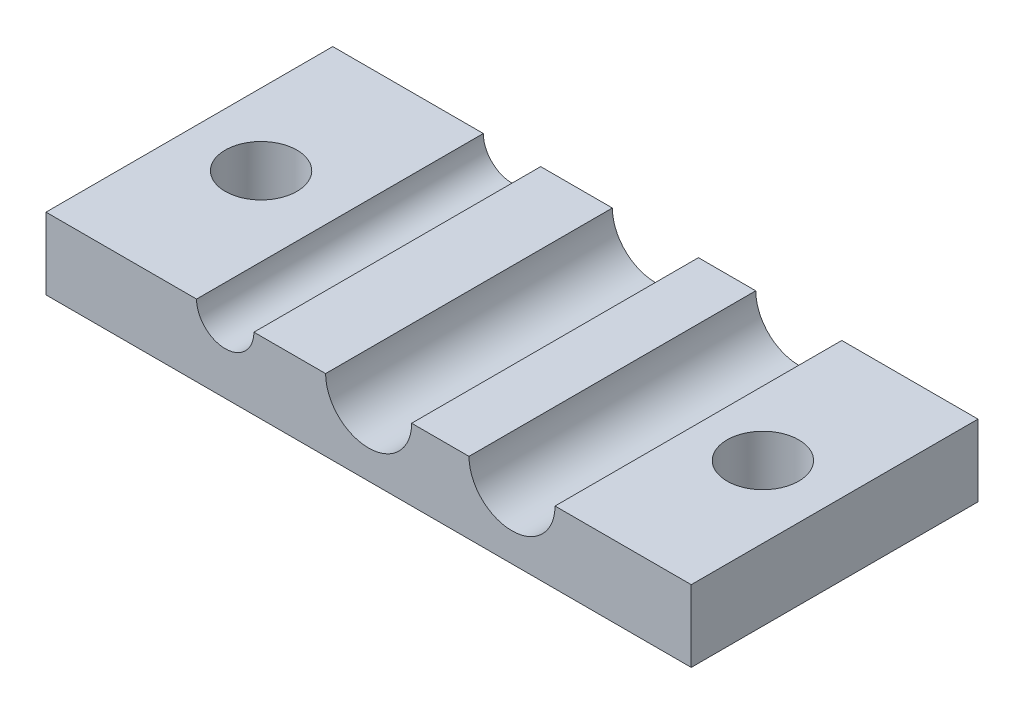
ISO-10303-21;
HEADER;
FILE_DESCRIPTION(('STEP AP214'),'2;1');
FILE_NAME('part.step','',(''),(''),'','','');
FILE_SCHEMA(('AUTOMOTIVE_DESIGN { 1 0 10303 214 1 1 1 1 }'));
ENDSEC;
DATA;
#1=APPLICATION_CONTEXT('core data for automotive mechanical design processes');
#2=APPLICATION_PROTOCOL_DEFINITION('international standard','automotive_design',2000,#1);
#3=PRODUCT_CONTEXT('',#1,'mechanical');
#4=PRODUCT('Part','Part','',(#3));
#5=PRODUCT_RELATED_PRODUCT_CATEGORY('part','',(#4));
#6=PRODUCT_DEFINITION_FORMATION('','',#4);
#7=PRODUCT_DEFINITION_CONTEXT('part definition',#1,'design');
#8=PRODUCT_DEFINITION('design','',#6,#7);
#9=PRODUCT_DEFINITION_SHAPE('','',#8);
#10=(LENGTH_UNIT() NAMED_UNIT(*) SI_UNIT(.MILLI.,.METRE.));
#11=(NAMED_UNIT(*) PLANE_ANGLE_UNIT() SI_UNIT($,.RADIAN.));
#12=(NAMED_UNIT(*) SI_UNIT($,.STERADIAN.) SOLID_ANGLE_UNIT());
#13=UNCERTAINTY_MEASURE_WITH_UNIT(LENGTH_MEASURE(1.E-05),#10,'distance_accuracy_value','');
#14=(GEOMETRIC_REPRESENTATION_CONTEXT(3) GLOBAL_UNCERTAINTY_ASSIGNED_CONTEXT((#13)) GLOBAL_UNIT_ASSIGNED_CONTEXT((#10,
#11,#12)) REPRESENTATION_CONTEXT('',''));
#15=CARTESIAN_POINT('',(0.,0.,0.));
#16=DIRECTION('',(0.,0.,1.));
#17=DIRECTION('',(1.,0.,0.));
#18=AXIS2_PLACEMENT_3D('',#15,#16,#17);
#19=CARTESIAN_POINT('',(13.,22.5,20.));
#20=DIRECTION('',(0.,-1.,0.));
#21=DIRECTION('',(0.,0.,-1.));
#22=AXIS2_PLACEMENT_3D('',#19,#20,#21);
#23=PLANE('',#22);
#24=CARTESIAN_POINT('',(17.5,22.5,10.));
#25=DIRECTION('',(0.,1.,0.));
#26=DIRECTION('',(0.,0.,-1.));
#27=AXIS2_PLACEMENT_3D('',#24,#25,#26);
#28=CIRCLE('',#27,2.5);
#29=CARTESIAN_POINT('',(17.5,22.5,7.5));
#30=VERTEX_POINT('',#29);
#31=EDGE_CURVE('E206',#30,#30,#28,.T.);
#32=ORIENTED_EDGE('',*,*,#31,.F.);
#33=EDGE_LOOP('',(#32));
#34=FACE_BOUND('',#33,.T.);
#35=DIRECTION('',(-1.,0.,0.));
#36=VECTOR('',#35,1.);
#37=CARTESIAN_POINT('',(13.,22.5,0.));
#38=LINE('',#37,#36);
#39=CARTESIAN_POINT('',(22.5,22.5,0.));
#40=VERTEX_POINT('',#39);
#41=CARTESIAN_POINT('',(13.,22.5,0.));
#42=VERTEX_POINT('',#41);
#43=EDGE_CURVE('E153',#40,#42,#38,.T.);
#44=ORIENTED_EDGE('',*,*,#43,.T.);
#45=DIRECTION('',(0.,0.,-1.));
#46=VECTOR('',#45,1.);
#47=CARTESIAN_POINT('',(13.,22.5,20.));
#48=LINE('',#47,#46);
#49=CARTESIAN_POINT('',(13.,22.5,20.));
#50=VERTEX_POINT('',#49);
#51=EDGE_CURVE('E11',#50,#42,#48,.T.);
#52=ORIENTED_EDGE('',*,*,#51,.F.);
#53=DIRECTION('',(-1.,0.,0.));
#54=VECTOR('',#53,1.);
#55=CARTESIAN_POINT('',(13.,22.5,20.));
#56=LINE('',#55,#54);
#57=CARTESIAN_POINT('',(22.5,22.5,20.));
#58=VERTEX_POINT('',#57);
#59=EDGE_CURVE('E172',#58,#50,#56,.T.);
#60=ORIENTED_EDGE('',*,*,#59,.F.);
#61=DIRECTION('',(0.,0.,-1.));
#62=VECTOR('',#61,1.);
#63=CARTESIAN_POINT('',(22.5,22.5,20.));
#64=LINE('',#63,#62);
#65=EDGE_CURVE('E152',#58,#40,#64,.T.);
#66=ORIENTED_EDGE('',*,*,#65,.T.);
#67=EDGE_LOOP('',(#44,#52,#60,#66));
#68=FACE_BOUND('',#67,.T.);
#69=ADVANCED_FACE('F38',(#34,#68),#23,.F.);
#70=CARTESIAN_POINT('',(10.,22.5,20.));
#71=DIRECTION('',(0.,0.,-1.));
#72=DIRECTION('',(-1.,0.,0.));
#73=AXIS2_PLACEMENT_3D('',#70,#71,#72);
#74=CYLINDRICAL_SURFACE('',#73,3.);
#75=CARTESIAN_POINT('',(10.,22.5,0.));
#76=DIRECTION('',(0.,0.,-1.));
#77=DIRECTION('',(1.,0.,0.));
#78=AXIS2_PLACEMENT_3D('',#75,#76,#77);
#79=CIRCLE('',#78,3.);
#80=CARTESIAN_POINT('',(7.,22.5,0.));
#81=VERTEX_POINT('',#80);
#82=EDGE_CURVE('E156',#42,#81,#79,.T.);
#83=ORIENTED_EDGE('',*,*,#82,.T.);
#84=DIRECTION('',(0.,0.,-1.));
#85=VECTOR('',#84,1.);
#86=CARTESIAN_POINT('',(7.,22.5,20.));
#87=LINE('',#86,#85);
#88=CARTESIAN_POINT('',(7.,22.5,20.));
#89=VERTEX_POINT('',#88);
#90=EDGE_CURVE('E46',#89,#81,#87,.T.);
#91=ORIENTED_EDGE('',*,*,#90,.F.);
#92=CARTESIAN_POINT('',(10.,22.5,20.));
#93=DIRECTION('',(0.,0.,-1.));
#94=DIRECTION('',(1.,0.,0.));
#95=AXIS2_PLACEMENT_3D('',#92,#93,#94);
#96=CIRCLE('',#95,3.);
#97=EDGE_CURVE('E104',#50,#89,#96,.T.);
#98=ORIENTED_EDGE('',*,*,#97,.F.);
#99=ORIENTED_EDGE('',*,*,#51,.T.);
#100=EDGE_LOOP('',(#83,#91,#98,#99));
#101=FACE_BOUND('',#100,.T.);
#102=ADVANCED_FACE('F226',(#101),#74,.F.);
#103=CARTESIAN_POINT('',(3.,22.5,20.));
#104=DIRECTION('',(0.,-1.,0.));
#105=DIRECTION('',(0.,0.,-1.));
#106=AXIS2_PLACEMENT_3D('',#103,#104,#105);
#107=PLANE('',#106);
#108=DIRECTION('',(-1.,0.,0.));
#109=VECTOR('',#108,1.);
#110=CARTESIAN_POINT('',(3.,22.5,0.));
#111=LINE('',#110,#109);
#112=CARTESIAN_POINT('',(3.,22.5,0.));
#113=VERTEX_POINT('',#112);
#114=EDGE_CURVE('E159',#81,#113,#111,.T.);
#115=ORIENTED_EDGE('',*,*,#114,.T.);
#116=DIRECTION('',(0.,0.,-1.));
#117=VECTOR('',#116,1.);
#118=CARTESIAN_POINT('',(3.,22.5,20.));
#119=LINE('',#118,#117);
#120=CARTESIAN_POINT('',(3.,22.5,20.));
#121=VERTEX_POINT('',#120);
#122=EDGE_CURVE('E179',#121,#113,#119,.T.);
#123=ORIENTED_EDGE('',*,*,#122,.F.);
#124=DIRECTION('',(-1.,0.,0.));
#125=VECTOR('',#124,1.);
#126=CARTESIAN_POINT('',(3.,22.5,20.));
#127=LINE('',#126,#125);
#128=EDGE_CURVE('E188',#89,#121,#127,.T.);
#129=ORIENTED_EDGE('',*,*,#128,.F.);
#130=ORIENTED_EDGE('',*,*,#90,.T.);
#131=EDGE_LOOP('',(#115,#123,#129,#130));
#132=FACE_BOUND('',#131,.T.);
#133=ADVANCED_FACE('F186',(#132),#107,.F.);
#134=CARTESIAN_POINT('',(0.,22.5,20.));
#135=DIRECTION('',(0.,0.,-1.));
#136=DIRECTION('',(-1.,0.,0.));
#137=AXIS2_PLACEMENT_3D('',#134,#135,#136);
#138=CYLINDRICAL_SURFACE('',#137,3.);
#139=CARTESIAN_POINT('',(0.,22.5,0.));
#140=DIRECTION('',(0.,0.,-1.));
#141=DIRECTION('',(1.,0.,0.));
#142=AXIS2_PLACEMENT_3D('',#139,#140,#141);
#143=CIRCLE('',#142,3.);
#144=CARTESIAN_POINT('',(-3.,22.5,0.));
#145=VERTEX_POINT('',#144);
#146=EDGE_CURVE('E161',#113,#145,#143,.T.);
#147=ORIENTED_EDGE('',*,*,#146,.T.);
#148=DIRECTION('',(0.,0.,-1.));
#149=VECTOR('',#148,1.);
#150=CARTESIAN_POINT('',(-3.,22.5,20.));
#151=LINE('',#150,#149);
#152=CARTESIAN_POINT('',(-3.,22.5,20.));
#153=VERTEX_POINT('',#152);
#154=EDGE_CURVE('E176',#153,#145,#151,.T.);
#155=ORIENTED_EDGE('',*,*,#154,.F.);
#156=CARTESIAN_POINT('',(0.,22.5,20.));
#157=DIRECTION('',(0.,0.,-1.));
#158=DIRECTION('',(1.,0.,0.));
#159=AXIS2_PLACEMENT_3D('',#156,#157,#158);
#160=CIRCLE('',#159,3.);
#161=EDGE_CURVE('E200',#121,#153,#160,.T.);
#162=ORIENTED_EDGE('',*,*,#161,.F.);
#163=ORIENTED_EDGE('',*,*,#122,.T.);
#164=EDGE_LOOP('',(#147,#155,#162,#163));
#165=FACE_BOUND('',#164,.T.);
#166=ADVANCED_FACE('F196',(#165),#138,.F.);
#167=CARTESIAN_POINT('',(-8.,22.5,20.));
#168=DIRECTION('',(0.,-1.,0.));
#169=DIRECTION('',(0.,0.,-1.));
#170=AXIS2_PLACEMENT_3D('',#167,#168,#169);
#171=PLANE('',#170);
#172=DIRECTION('',(-1.,0.,0.));
#173=VECTOR('',#172,1.);
#174=CARTESIAN_POINT('',(-8.,22.5,0.));
#175=LINE('',#174,#173);
#176=CARTESIAN_POINT('',(-8.,22.5,0.));
#177=VERTEX_POINT('',#176);
#178=EDGE_CURVE('E163',#145,#177,#175,.T.);
#179=ORIENTED_EDGE('',*,*,#178,.T.);
#180=DIRECTION('',(0.,0.,-1.));
#181=VECTOR('',#180,1.);
#182=CARTESIAN_POINT('',(-8.,22.5,20.));
#183=LINE('',#182,#181);
#184=CARTESIAN_POINT('',(-8.,22.5,20.));
#185=VERTEX_POINT('',#184);
#186=EDGE_CURVE('E140',#185,#177,#183,.T.);
#187=ORIENTED_EDGE('',*,*,#186,.F.);
#188=DIRECTION('',(-1.,0.,0.));
#189=VECTOR('',#188,1.);
#190=CARTESIAN_POINT('',(-8.,22.5,20.));
#191=LINE('',#190,#189);
#192=EDGE_CURVE('E128',#153,#185,#191,.T.);
#193=ORIENTED_EDGE('',*,*,#192,.F.);
#194=ORIENTED_EDGE('',*,*,#154,.T.);
#195=EDGE_LOOP('',(#179,#187,#193,#194));
#196=FACE_BOUND('',#195,.T.);
#197=ADVANCED_FACE('F199',(#196),#171,.F.);
#198=CARTESIAN_POINT('',(-10.,22.5,20.));
#199=DIRECTION('',(0.,0.,-1.));
#200=DIRECTION('',(-1.,0.,0.));
#201=AXIS2_PLACEMENT_3D('',#198,#199,#200);
#202=CYLINDRICAL_SURFACE('',#201,2.);
#203=CARTESIAN_POINT('',(-10.,22.5,0.));
#204=DIRECTION('',(0.,0.,-1.));
#205=DIRECTION('',(1.,0.,0.));
#206=AXIS2_PLACEMENT_3D('',#203,#204,#205);
#207=CIRCLE('',#206,2.);
#208=CARTESIAN_POINT('',(-12.,22.5,0.));
#209=VERTEX_POINT('',#208);
#210=EDGE_CURVE('E137',#177,#209,#207,.T.);
#211=ORIENTED_EDGE('',*,*,#210,.T.);
#212=DIRECTION('',(0.,0.,-1.));
#213=VECTOR('',#212,1.);
#214=CARTESIAN_POINT('',(-12.,22.5,20.));
#215=LINE('',#214,#213);
#216=CARTESIAN_POINT('',(-12.,22.5,20.));
#217=VERTEX_POINT('',#216);
#218=EDGE_CURVE('E134',#217,#209,#215,.T.);
#219=ORIENTED_EDGE('',*,*,#218,.F.);
#220=CARTESIAN_POINT('',(-10.,22.5,20.));
#221=DIRECTION('',(0.,0.,-1.));
#222=DIRECTION('',(1.,0.,0.));
#223=AXIS2_PLACEMENT_3D('',#220,#221,#222);
#224=CIRCLE('',#223,2.);
#225=EDGE_CURVE('E120',#185,#217,#224,.T.);
#226=ORIENTED_EDGE('',*,*,#225,.F.);
#227=ORIENTED_EDGE('',*,*,#186,.T.);
#228=EDGE_LOOP('',(#211,#219,#226,#227));
#229=FACE_BOUND('',#228,.T.);
#230=ADVANCED_FACE('F135',(#229),#202,.F.);
#231=CARTESIAN_POINT('',(-22.5,22.5,20.));
#232=DIRECTION('',(0.,-1.,0.));
#233=DIRECTION('',(0.,0.,-1.));
#234=AXIS2_PLACEMENT_3D('',#231,#232,#233);
#235=PLANE('',#234);
#236=CARTESIAN_POINT('',(-17.5,22.5,10.));
#237=DIRECTION('',(0.,1.,0.));
#238=DIRECTION('',(0.,0.,1.));
#239=AXIS2_PLACEMENT_3D('',#236,#237,#238);
#240=CIRCLE('',#239,2.5);
#241=CARTESIAN_POINT('',(-17.5,22.5,12.5));
#242=VERTEX_POINT('',#241);
#243=EDGE_CURVE('E157',#242,#242,#240,.T.);
#244=ORIENTED_EDGE('',*,*,#243,.F.);
#245=EDGE_LOOP('',(#244));
#246=FACE_BOUND('',#245,.T.);
#247=DIRECTION('',(-1.,0.,0.));
#248=VECTOR('',#247,1.);
#249=CARTESIAN_POINT('',(-22.5,22.5,0.));
#250=LINE('',#249,#248);
#251=CARTESIAN_POINT('',(-22.5,22.5,0.));
#252=VERTEX_POINT('',#251);
#253=EDGE_CURVE('E166',#209,#252,#250,.T.);
#254=ORIENTED_EDGE('',*,*,#253,.T.);
#255=DIRECTION('',(0.,0.,-1.));
#256=VECTOR('',#255,1.);
#257=CARTESIAN_POINT('',(-22.5,22.5,20.));
#258=LINE('',#257,#256);
#259=CARTESIAN_POINT('',(-22.5,22.5,20.));
#260=VERTEX_POINT('',#259);
#261=EDGE_CURVE('E141',#260,#252,#258,.T.);
#262=ORIENTED_EDGE('',*,*,#261,.F.);
#263=DIRECTION('',(-1.,0.,0.));
#264=VECTOR('',#263,1.);
#265=CARTESIAN_POINT('',(-22.5,22.5,20.));
#266=LINE('',#265,#264);
#267=EDGE_CURVE('E125',#217,#260,#266,.T.);
#268=ORIENTED_EDGE('',*,*,#267,.F.);
#269=ORIENTED_EDGE('',*,*,#218,.T.);
#270=EDGE_LOOP('',(#254,#262,#268,#269));
#271=FACE_BOUND('',#270,.T.);
#272=ADVANCED_FACE('F143',(#246,#271),#235,.F.);
#273=CARTESIAN_POINT('',(-22.5,-22.5,20.));
#274=DIRECTION('',(1.,0.,0.));
#275=DIRECTION('',(0.,0.,-1.));
#276=AXIS2_PLACEMENT_3D('',#273,#274,#275);
#277=PLANE('',#276);
#278=DIRECTION('',(0.,-1.,0.));
#279=VECTOR('',#278,1.);
#280=CARTESIAN_POINT('',(-22.5,-22.5,0.));
#281=LINE('',#280,#279);
#282=CARTESIAN_POINT('',(-22.5,17.5,0.));
#283=VERTEX_POINT('',#282);
#284=EDGE_CURVE('E168',#252,#283,#281,.T.);
#285=ORIENTED_EDGE('',*,*,#284,.T.);
#286=DIRECTION('',(0.,0.,-1.));
#287=VECTOR('',#286,1.);
#288=CARTESIAN_POINT('',(-22.5,17.5,20.));
#289=LINE('',#288,#287);
#290=CARTESIAN_POINT('',(-22.5,17.5,20.));
#291=VERTEX_POINT('',#290);
#292=EDGE_CURVE('E53',#291,#283,#289,.T.);
#293=ORIENTED_EDGE('',*,*,#292,.F.);
#294=DIRECTION('',(0.,-1.,0.));
#295=VECTOR('',#294,1.);
#296=CARTESIAN_POINT('',(-22.5,-22.5,20.));
#297=LINE('',#296,#295);
#298=EDGE_CURVE('E146',#260,#291,#297,.T.);
#299=ORIENTED_EDGE('',*,*,#298,.F.);
#300=ORIENTED_EDGE('',*,*,#261,.T.);
#301=EDGE_LOOP('',(#285,#293,#299,#300));
#302=FACE_BOUND('',#301,.T.);
#303=ADVANCED_FACE('F243',(#302),#277,.F.);
#304=CARTESIAN_POINT('',(22.5,-22.5,20.));
#305=DIRECTION('',(-1.,0.,0.));
#306=DIRECTION('',(0.,0.,1.));
#307=AXIS2_PLACEMENT_3D('',#304,#305,#306);
#308=PLANE('',#307);
#309=DIRECTION('',(0.,1.,0.));
#310=VECTOR('',#309,1.);
#311=CARTESIAN_POINT('',(22.5,-22.5,20.));
#312=LINE('',#311,#310);
#313=CARTESIAN_POINT('',(22.5,17.5,20.));
#314=VERTEX_POINT('',#313);
#315=EDGE_CURVE('E62',#314,#58,#312,.T.);
#316=ORIENTED_EDGE('',*,*,#315,.F.);
#317=DIRECTION('',(0.,0.,-1.));
#318=VECTOR('',#317,1.);
#319=CARTESIAN_POINT('',(22.5,17.5,20.));
#320=LINE('',#319,#318);
#321=CARTESIAN_POINT('',(22.5,17.5,0.));
#322=VERTEX_POINT('',#321);
#323=EDGE_CURVE('E215',#314,#322,#320,.T.);
#324=ORIENTED_EDGE('',*,*,#323,.T.);
#325=DIRECTION('',(0.,1.,0.));
#326=VECTOR('',#325,1.);
#327=CARTESIAN_POINT('',(22.5,-22.5,0.));
#328=LINE('',#327,#326);
#329=EDGE_CURVE('E96',#322,#40,#328,.T.);
#330=ORIENTED_EDGE('',*,*,#329,.T.);
#331=ORIENTED_EDGE('',*,*,#65,.F.);
#332=EDGE_LOOP('',(#316,#324,#330,#331));
#333=FACE_BOUND('',#332,.T.);
#334=ADVANCED_FACE('F222',(#333),#308,.F.);
#335=CARTESIAN_POINT('',(-10.,22.5,20.));
#336=DIRECTION('',(0.,0.,1.));
#337=DIRECTION('',(1.,0.,0.));
#338=AXIS2_PLACEMENT_3D('',#335,#336,#337);
#339=PLANE('',#338);
#340=DIRECTION('',(1.,0.,0.));
#341=VECTOR('',#340,1.);
#342=CARTESIAN_POINT('',(22.5,17.5,20.));
#343=LINE('',#342,#341);
#344=EDGE_CURVE('E216',#291,#314,#343,.T.);
#345=ORIENTED_EDGE('',*,*,#344,.T.);
#346=ORIENTED_EDGE('',*,*,#315,.T.);
#347=ORIENTED_EDGE('',*,*,#59,.T.);
#348=ORIENTED_EDGE('',*,*,#97,.T.);
#349=ORIENTED_EDGE('',*,*,#128,.T.);
#350=ORIENTED_EDGE('',*,*,#161,.T.);
#351=ORIENTED_EDGE('',*,*,#192,.T.);
#352=ORIENTED_EDGE('',*,*,#225,.T.);
#353=ORIENTED_EDGE('',*,*,#267,.T.);
#354=ORIENTED_EDGE('',*,*,#298,.T.);
#355=EDGE_LOOP('',(#345,#346,#347,#348,#349,#350,#351,#352,#353,#354));
#356=FACE_BOUND('',#355,.T.);
#357=ADVANCED_FACE('F122',(#356),#339,.T.);
#358=CARTESIAN_POINT('',(-10.,22.5,0.));
#359=DIRECTION('',(0.,0.,1.));
#360=DIRECTION('',(1.,0.,0.));
#361=AXIS2_PLACEMENT_3D('',#358,#359,#360);
#362=PLANE('',#361);
#363=ORIENTED_EDGE('',*,*,#329,.F.);
#364=DIRECTION('',(1.,0.,0.));
#365=VECTOR('',#364,1.);
#366=CARTESIAN_POINT('',(22.5,17.5,0.));
#367=LINE('',#366,#365);
#368=EDGE_CURVE('E218',#283,#322,#367,.T.);
#369=ORIENTED_EDGE('',*,*,#368,.F.);
#370=ORIENTED_EDGE('',*,*,#284,.F.);
#371=ORIENTED_EDGE('',*,*,#253,.F.);
#372=ORIENTED_EDGE('',*,*,#210,.F.);
#373=ORIENTED_EDGE('',*,*,#178,.F.);
#374=ORIENTED_EDGE('',*,*,#146,.F.);
#375=ORIENTED_EDGE('',*,*,#114,.F.);
#376=ORIENTED_EDGE('',*,*,#82,.F.);
#377=ORIENTED_EDGE('',*,*,#43,.F.);
#378=EDGE_LOOP('',(#363,#369,#370,#371,#372,#373,#374,#375,#376,#377));
#379=FACE_BOUND('',#378,.T.);
#380=ADVANCED_FACE('F191',(#379),#362,.F.);
#381=CARTESIAN_POINT('',(-17.5,2.5,10.));
#382=DIRECTION('',(0.,1.,0.));
#383=DIRECTION('',(0.,0.,1.));
#384=AXIS2_PLACEMENT_3D('',#381,#382,#383);
#385=CYLINDRICAL_SURFACE('',#384,2.5);
#386=CARTESIAN_POINT('',(-17.5,17.5,10.));
#387=DIRECTION('',(0.,1.,0.));
#388=DIRECTION('',(-1.,0.,0.));
#389=AXIS2_PLACEMENT_3D('',#386,#387,#388);
#390=CIRCLE('',#389,2.5);
#391=CARTESIAN_POINT('',(-20.,17.5,10.));
#392=VERTEX_POINT('',#391);
#393=EDGE_CURVE('E209',#392,#392,#390,.F.);
#394=ORIENTED_EDGE('',*,*,#393,.T.);
#395=EDGE_LOOP('',(#394));
#396=FACE_BOUND('',#395,.T.);
#397=ORIENTED_EDGE('',*,*,#243,.T.);
#398=EDGE_LOOP('',(#397));
#399=FACE_BOUND('',#398,.T.);
#400=ADVANCED_FACE('F252',(#396,#399),#385,.F.);
#401=CARTESIAN_POINT('',(17.5,2.5,10.));
#402=DIRECTION('',(0.,1.,0.));
#403=DIRECTION('',(0.,0.,1.));
#404=AXIS2_PLACEMENT_3D('',#401,#402,#403);
#405=CYLINDRICAL_SURFACE('',#404,2.5);
#406=CARTESIAN_POINT('',(17.5,17.5,10.));
#407=DIRECTION('',(0.,1.,0.));
#408=DIRECTION('',(-1.,0.,0.));
#409=AXIS2_PLACEMENT_3D('',#406,#407,#408);
#410=CIRCLE('',#409,2.5);
#411=CARTESIAN_POINT('',(15.,17.5,10.));
#412=VERTEX_POINT('',#411);
#413=EDGE_CURVE('E41',#412,#412,#410,.F.);
#414=ORIENTED_EDGE('',*,*,#413,.T.);
#415=EDGE_LOOP('',(#414));
#416=FACE_BOUND('',#415,.T.);
#417=ORIENTED_EDGE('',*,*,#31,.T.);
#418=EDGE_LOOP('',(#417));
#419=FACE_BOUND('',#418,.T.);
#420=ADVANCED_FACE('F255',(#416,#419),#405,.F.);
#421=CARTESIAN_POINT('',(22.5,17.5,20.));
#422=DIRECTION('',(0.,1.,0.));
#423=DIRECTION('',(-1.,0.,0.));
#424=AXIS2_PLACEMENT_3D('',#421,#422,#423);
#425=PLANE('',#424);
#426=ORIENTED_EDGE('',*,*,#413,.F.);
#427=EDGE_LOOP('',(#426));
#428=FACE_BOUND('',#427,.T.);
#429=ORIENTED_EDGE('',*,*,#368,.T.);
#430=ORIENTED_EDGE('',*,*,#323,.F.);
#431=ORIENTED_EDGE('',*,*,#344,.F.);
#432=ORIENTED_EDGE('',*,*,#292,.T.);
#433=EDGE_LOOP('',(#429,#430,#431,#432));
#434=FACE_BOUND('',#433,.T.);
#435=ORIENTED_EDGE('',*,*,#393,.F.);
#436=EDGE_LOOP('',(#435));
#437=FACE_BOUND('',#436,.T.);
#438=ADVANCED_FACE('F258',(#428,#434,#437),#425,.F.);
#439=CLOSED_SHELL('',(#69,#102,#133,#166,#197,#230,#272,#303,#334,#357,#380,#400,#420,#438));
#440=MANIFOLD_SOLID_BREP('B2',#439);
#441=ADVANCED_BREP_SHAPE_REPRESENTATION('',(#18,#440),#14);
#442=SHAPE_DEFINITION_REPRESENTATION(#9,#441);
ENDSEC;
END-ISO-10303-21;
